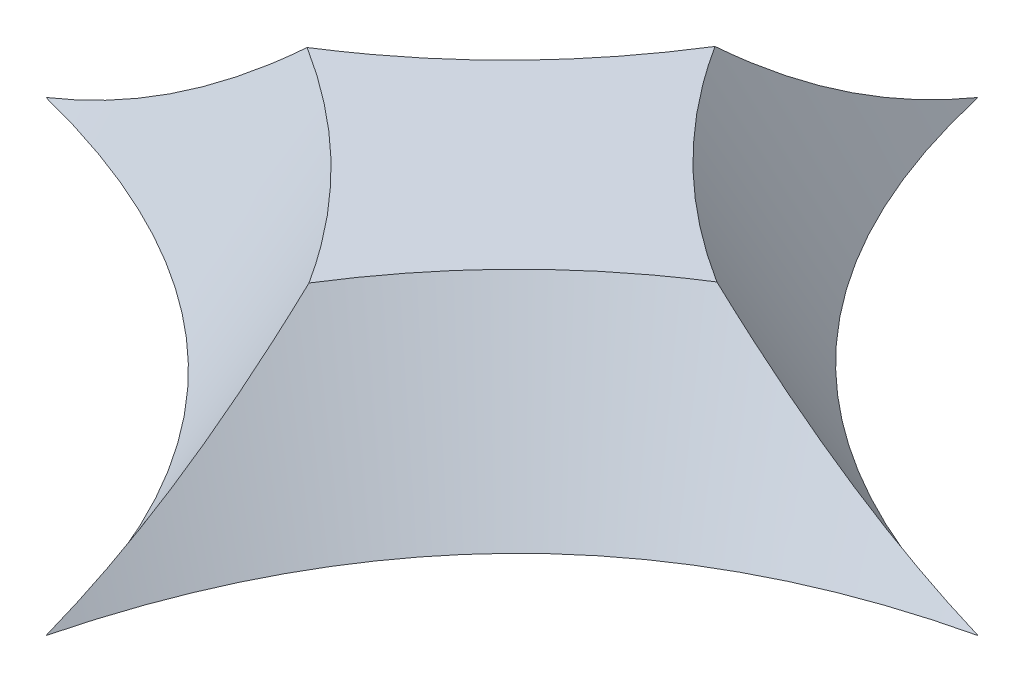
ISO-10303-21;
HEADER;
FILE_DESCRIPTION(('STEP AP214'),'2;1');
FILE_NAME('part.step','',(''),(''),'','','');
FILE_SCHEMA(('AUTOMOTIVE_DESIGN { 1 0 10303 214 1 1 1 1 }'));
ENDSEC;
DATA;
#1=APPLICATION_CONTEXT('core data for automotive mechanical design processes');
#2=APPLICATION_PROTOCOL_DEFINITION('international standard','automotive_design',2000,#1);
#3=PRODUCT_CONTEXT('',#1,'mechanical');
#4=PRODUCT('Part','Part','',(#3));
#5=PRODUCT_RELATED_PRODUCT_CATEGORY('part','',(#4));
#6=PRODUCT_DEFINITION_FORMATION('','',#4);
#7=PRODUCT_DEFINITION_CONTEXT('part definition',#1,'design');
#8=PRODUCT_DEFINITION('design','',#6,#7);
#9=PRODUCT_DEFINITION_SHAPE('','',#8);
#10=(LENGTH_UNIT() NAMED_UNIT(*) SI_UNIT(.MILLI.,.METRE.));
#11=(NAMED_UNIT(*) PLANE_ANGLE_UNIT() SI_UNIT($,.RADIAN.));
#12=(NAMED_UNIT(*) SI_UNIT($,.STERADIAN.) SOLID_ANGLE_UNIT());
#13=UNCERTAINTY_MEASURE_WITH_UNIT(LENGTH_MEASURE(1.E-05),#10,'distance_accuracy_value','');
#14=(GEOMETRIC_REPRESENTATION_CONTEXT(3) GLOBAL_UNCERTAINTY_ASSIGNED_CONTEXT((#13)) GLOBAL_UNIT_ASSIGNED_CONTEXT((#10,
#11,#12)) REPRESENTATION_CONTEXT('',''));
#15=CARTESIAN_POINT('',(0.,0.,0.));
#16=DIRECTION('',(0.,0.,1.));
#17=DIRECTION('',(1.,0.,0.));
#18=AXIS2_PLACEMENT_3D('',#15,#16,#17);
#19=CARTESIAN_POINT('',(0.,0.,-8.));
#20=CARTESIAN_POINT('',(-0.275764776781379,0.,-6.90933460925183));
#21=CARTESIAN_POINT('',(-0.649255026033141,0.,-5.92466889952442));
#22=CARTESIAN_POINT('',(-1.5916864694806,0.,-4.16733684210909));
#23=CARTESIAN_POINT('',(-2.1606276636759,0.,-3.39467049442248));
#24=CARTESIAN_POINT('',(-3.49396099700911,0.,-2.06133716108887));
#25=CARTESIAN_POINT('',(-4.25835313614752,0.,-1.50067017544263));
#26=CARTESIAN_POINT('',(-5.98258835936625,0.,-0.591335566190908));
#27=CARTESIAN_POINT('',(-6.94243144344786,0.,-0.242667942586027));
#28=CARTESIAN_POINT('',(-8.,0.,0.));
#29=CARTESIAN_POINT('',(2.01504918773142,3.6,-7.49051322782323));
#30=CARTESIAN_POINT('',(1.70297305232779,3.6,-6.25623434341139));
#31=CARTESIAN_POINT('',(1.27190158898021,3.6,-5.10919619744064));
#32=CARTESIAN_POINT('',(0.150529163695324,3.6,-3.01819666344593));
#33=CARTESIAN_POINT('',(-0.541227016658254,3.6,-2.07468344995853));
#34=CARTESIAN_POINT('',(-2.17397395268695,3.6,-0.441936514212987));
#35=CARTESIAN_POINT('',(-3.11355026086498,3.6,0.245374439857077));
#36=CARTESIAN_POINT('',(-5.18824372550521,3.6,1.33953522925552));
#37=CARTESIAN_POINT('',(-6.32240038355145,3.6,1.74753652130328));
#38=CARTESIAN_POINT('',(-7.53515997110178,3.6,2.02581434182252));
#39=B_SPLINE_SURFACE_WITH_KNOTS('',1,3,((#19,#20,#21,#22,#23,#24,#25,#26,#27,#28),(#29,#30,#31,
#32,#33,#34,#35,#36,#37,#38)),.UNSPECIFIED.,.F.,.F.,.F.,(2,2),(4,2,2,2,4),(0.,1.),(0.,0.25,0.5,
0.75,1.),.UNSPECIFIED.);
#40=CARTESIAN_POINT('',(0.,0.,-8.));
#41=CARTESIAN_POINT('',(-0.0573909267313728,0.,-7.77303467409908));
#42=CARTESIAN_POINT('',(-0.119854685287259,0.,-7.54729808256133));
#43=CARTESIAN_POINT('',(-0.255893657694453,0.,-7.09850236238939));
#44=CARTESIAN_POINT('',(-0.329500101076737,0.,-6.87545272360224));
#45=CARTESIAN_POINT('',(-0.488543783053675,0.,-6.43335590264357));
#46=CARTESIAN_POINT('',(-0.573991749906029,0.,-6.21431255615508));
#47=CARTESIAN_POINT('',(-0.757918447436487,0.,-5.78026267058959));
#48=CARTESIAN_POINT('',(-0.85646903900896,0.,-5.56528645431373));
#49=CARTESIAN_POINT('',(-1.06674897596929,0.,-5.14209245391446));
#50=CARTESIAN_POINT('',(-1.17846668066953,0.,-4.93386890458644));
#51=CARTESIAN_POINT('',(-1.41553407069375,0.,-4.52544956752358));
#52=CARTESIAN_POINT('',(-1.54087601340602,0.,-4.32524930780992));
#53=CARTESIAN_POINT('',(-1.7727345311255,0.,-3.98250670964699));
#54=CARTESIAN_POINT('',(-1.87625809102295,0.,-3.8379329538665));
#55=CARTESIAN_POINT('',(-2.09112990897493,0.,-3.55468658486988));
#56=CARTESIAN_POINT('',(-2.20247890597677,0.,-3.41601453093536));
#57=CARTESIAN_POINT('',(-2.43283559938971,0.,-3.14518605266298));
#58=CARTESIAN_POINT('',(-2.55184313117557,0.,-3.01302948837818));
#59=CARTESIAN_POINT('',(-2.79674245772837,0.,-2.75629995241361));
#60=CARTESIAN_POINT('',(-2.92260366249044,0.,-2.63169780903271));
#61=CARTESIAN_POINT('',(-3.18129187477434,0.,-2.3899378215228));
#62=CARTESIAN_POINT('',(-3.31411901973247,0.,-2.27278012437183));
#63=CARTESIAN_POINT('',(-3.58625019284958,0.,-2.04628323609106));
#64=CARTESIAN_POINT('',(-3.72555378671812,0.,-1.93694352195604));
#65=CARTESIAN_POINT('',(-4.08099343830081,0.,-1.67387151824939));
#66=CARTESIAN_POINT('',(-4.30085496157446,0.,-1.52513721384507));
#67=CARTESIAN_POINT('',(-4.75195565930856,0.,-1.24611843915864));
#68=CARTESIAN_POINT('',(-4.98319584603708,0.,-1.11583561436901));
#69=CARTESIAN_POINT('',(-5.45558088026412,0.,-0.873205699555676));
#70=CARTESIAN_POINT('',(-5.69674844502894,0.,-0.760902993108565));
#71=CARTESIAN_POINT('',(-6.18646403652967,0.,-0.553975690531041));
#72=CARTESIAN_POINT('',(-6.43501062586645,0.,-0.459347677301566));
#73=CARTESIAN_POINT('',(-6.90226643955803,0.,-0.298957608287093));
#74=CARTESIAN_POINT('',(-7.12023249444522,0.,-0.231006276000716));
#75=CARTESIAN_POINT('',(-7.55841476758187,0.,-0.106953304416239));
#76=CARTESIAN_POINT('',(-7.77861562926881,0.,-0.0507975615072492));
#77=CARTESIAN_POINT('',(-8.,0.,0.));
#78=B_SPLINE_CURVE_WITH_KNOTS('',3,(#40,#41,#42,#43,#44,#45,#46,#47,#48,#49,#50,#51,#52,#53,#54,
#55,#56,#57,#58,#59,#60,#61,#62,#63,#64,#65,#66,#67,#68,#69,#70,#71,#72,#73,#74,#75,#76,#77),
.UNSPECIFIED.,.F.,.F.,(4,2,2,2,2,2,2,2,2,2,2,2,2,2,2,2,2,2,4),(0.,0.7023468421379,
1.40669989477939,2.11169530501088,2.82073034609147,3.52914318520881,4.23715551982289,
4.770356280917,5.30360745939214,5.83684717910971,6.36787593841666,6.89891517873646,
7.42991886043982,8.22527016763761,9.02069235921077,9.81804873037485,10.615250786423,
11.2998716610307,11.981280246212),.UNSPECIFIED.);
#79=CARTESIAN_POINT('',(0.,0.,-8.));
#80=VERTEX_POINT('',#79);
#81=CARTESIAN_POINT('',(-8.,0.,0.));
#82=VERTEX_POINT('',#81);
#83=EDGE_CURVE('E88',#80,#82,#78,.T.);
#84=CARTESIAN_POINT('',(-3.50132772897756,3.,0.0157700357295836));
#85=CARTESIAN_POINT('',(-3.58660217696573,2.92112802964647,0.0159980146188451));
#86=CARTESIAN_POINT('',(-3.67245229229549,2.84287541612625,0.0162083731137651));
#87=CARTESIAN_POINT('',(-3.84536449994943,2.68771769262917,0.0165873250040903));
#88=CARTESIAN_POINT('',(-3.93242661683495,2.61081261003169,0.0167559175517992));
#89=CARTESIAN_POINT('',(-4.10781736378828,2.458464250142,0.017044799089178));
#90=CARTESIAN_POINT('',(-4.19614595551017,2.383020928753,0.0171650895381377));
#91=CARTESIAN_POINT('',(-4.37360332082983,2.23416007046157,0.0173499846073553));
#92=CARTESIAN_POINT('',(-4.46272423275304,2.16073316717273,0.0174149155236976));
#93=CARTESIAN_POINT('',(-4.64233028676929,2.01555801232064,0.0174795083486336));
#94=CARTESIAN_POINT('',(-4.73281548247838,1.94380982701487,0.0174791676853481));
#95=CARTESIAN_POINT('',(-4.915205521287,1.80211050933092,0.0174098815796205));
#96=CARTESIAN_POINT('',(-5.00711059749483,1.7321596771623,0.0173409247517447));
#97=CARTESIAN_POINT('',(-5.24840276627304,1.55247951754864,0.0170616314444812));
#98=CARTESIAN_POINT('',(-5.39893569583631,1.44428062797032,0.0167910096648436));
#99=CARTESIAN_POINT('',(-5.70388428168913,1.23348697507864,0.0160216384070382));
#100=CARTESIAN_POINT('',(-5.85830001119456,1.13089231755719,0.0155228846240537));
#101=CARTESIAN_POINT('',(-6.17106307157052,0.931949956628384,0.0142645485810968));
#102=CARTESIAN_POINT('',(-6.32940949223654,0.835600825306767,0.0135050261924541));
#103=CARTESIAN_POINT('',(-6.65156555757409,0.648875115144405,0.011685513758406));
#104=CARTESIAN_POINT('',(-6.81541234852834,0.558562518245528,0.0106227912216009));
#105=CARTESIAN_POINT('',(-7.14711761462272,0.38548510204566,0.00817086177547362));
#106=CARTESIAN_POINT('',(-7.31497733010064,0.30272265547193,0.00678155271959889));
#107=CARTESIAN_POINT('',(-7.65463266399603,0.145197811538302,0.0036559275484466));
#108=CARTESIAN_POINT('',(-7.82643249828716,0.0704445199700137,0.0019192227669836));
#109=CARTESIAN_POINT('',(-8.,0.,0.));
#110=B_SPLINE_CURVE_WITH_KNOTS('',3,(#84,#85,#86,#87,#88,#89,#90,#91,#92,#93,#94,#95,#96,#97,
#98,#99,#100,#101,#102,#103,#104,#105,#106,#107,#108,#109),.UNSPECIFIED.,.F.,.F.,(4,2,2,2,2,2,2,
2,2,2,2,2,4),(0.,0.348472495548215,0.696952063236257,1.04542110196226,1.39182173398816,
1.73823601515167,2.08470778618874,2.64073838646123,3.19677947938069,3.75269299297884,
4.31378394461425,4.87505062286499,5.43694879400663),.UNSPECIFIED.);
#111=CARTESIAN_POINT('',(-3.50132772897756,3.,0.0157700357295836));
#112=VERTEX_POINT('',#111);
#113=EDGE_CURVE('E11',#112,#82,#110,.T.);
#114=CARTESIAN_POINT('',(-0.0157700357296791,3.,-3.50132772897746));
#115=CARTESIAN_POINT('',(-0.102341480085947,3.,-3.36343232745548));
#116=CARTESIAN_POINT('',(-0.191703158816903,3.,-3.22731545107103));
#117=CARTESIAN_POINT('',(-0.37602015824517,3.,-2.95890102655863));
#118=CARTESIAN_POINT('',(-0.470976132008466,3.,-2.82660392704009));
#119=CARTESIAN_POINT('',(-0.764319802881898,3.,-2.43575584067087));
#120=CARTESIAN_POINT('',(-0.971098310636349,3.,-2.18338392189374));
#121=CARTESIAN_POINT('',(-1.29518222680969,3.,-1.82164538706248));
#122=CARTESIAN_POINT('',(-1.40440162663122,3.,-1.70492602642679));
#123=CARTESIAN_POINT('',(-1.62785883192801,3.,-1.47638812504596));
#124=CARTESIAN_POINT('',(-1.7420968306769,3.,-1.36456977337775));
#125=CARTESIAN_POINT('',(-2.09185897017497,3.,-1.03697333025701));
#126=CARTESIAN_POINT('',(-2.33464745693901,3.,-0.828812397069436));
#127=CARTESIAN_POINT('',(-2.65915788919417,3.,-0.574042670220229));
#128=CARTESIAN_POINT('',(-2.73320245346723,3.,-0.517406828527924));
#129=CARTESIAN_POINT('',(-2.88267960249897,3.,-0.406009983944878));
#130=CARTESIAN_POINT('',(-2.95811196514096,3.,-0.351248684979181));
#131=CARTESIAN_POINT('',(-3.11074635622329,3.,-0.243312042794778));
#132=CARTESIAN_POINT('',(-3.18795602064874,3.,-0.190147517959262));
#133=CARTESIAN_POINT('',(-3.34368009673592,3.,-0.0857408693182144));
#134=CARTESIAN_POINT('',(-3.4221946890948,3.,-0.0344990150051708));
#135=CARTESIAN_POINT('',(-3.50132772897756,3.,0.0157700357295835));
#136=B_SPLINE_CURVE_WITH_KNOTS('',3,(#114,#115,#116,#117,#118,#119,#120,#121,#122,#123,#124,
#125,#126,#127,#128,#129,#130,#131,#132,#133,#134,#135),.UNSPECIFIED.,.F.,.F.,(4,2,2,2,2,2,2,2,
2,2,4),(0.,0.488371756664548,0.976800638202283,1.9541376089455,2.43356276651518,
2.91300640366669,3.87092454869332,4.1505770741507,4.43018522410616,4.7113870444757,
4.99262813357079),.UNSPECIFIED.);
#137=CARTESIAN_POINT('',(-0.0157700357296791,3.,-3.50132772897746));
#138=VERTEX_POINT('',#137);
#139=EDGE_CURVE('E139',#138,#112,#136,.T.);
#140=CARTESIAN_POINT('',(-0.0157700357296791,3.,-3.50132772897746));
#141=CARTESIAN_POINT('',(-0.0159980146189361,2.92112802964647,-3.58660217696563));
#142=CARTESIAN_POINT('',(-0.0162083731138511,2.84287541612625,-3.67245229229539));
#143=CARTESIAN_POINT('',(-0.0165873250041641,2.68771769262917,-3.84536449994933));
#144=CARTESIAN_POINT('',(-0.0167559175518658,2.6108126100317,-3.93242661683486));
#145=CARTESIAN_POINT('',(-0.017044799089227,2.45846425014202,-4.10781736378819));
#146=CARTESIAN_POINT('',(-0.0171650895381762,2.38302092875302,-4.19614595551009));
#147=CARTESIAN_POINT('',(-0.0173499846073688,2.23416007046159,-4.37360332082975));
#148=CARTESIAN_POINT('',(-0.0174149155236967,2.16073316717276,-4.46272423275297));
#149=CARTESIAN_POINT('',(-0.0174795083486073,2.01555801232068,-4.64233028676922));
#150=CARTESIAN_POINT('',(-0.0174791676853109,1.94380982701493,-4.73281548247832));
#151=CARTESIAN_POINT('',(-0.0174098815795715,1.80211050933099,-4.91520552128696));
#152=CARTESIAN_POINT('',(-0.0173409247516949,1.73215967716238,-5.00711059749479));
#153=CARTESIAN_POINT('',(-0.017061631444434,1.55247951754872,-5.24840276627301));
#154=CARTESIAN_POINT('',(-0.0167910096648026,1.44428062797041,-5.39893569583629));
#155=CARTESIAN_POINT('',(-0.0160216384070138,1.23348697507872,-5.70388428168912));
#156=CARTESIAN_POINT('',(-0.0155228846240396,1.13089231755727,-5.85830001119456));
#157=CARTESIAN_POINT('',(-0.0142645485810998,0.931949956628448,-6.17106307157052));
#158=CARTESIAN_POINT('',(-0.0135050261924638,0.835600825306823,-6.32940949223654));
#159=CARTESIAN_POINT('',(-0.0116855137584216,0.648875115144443,-6.65156555757409));
#160=CARTESIAN_POINT('',(-0.0106227912216156,0.558562518245558,-6.81541234852833));
#161=CARTESIAN_POINT('',(-0.00817086177548192,0.38548510204567,-7.1471176146227));
#162=CARTESIAN_POINT('',(-0.00678155271960162,0.30272265547193,-7.31497733010063));
#163=CARTESIAN_POINT('',(-0.00365592754843467,0.145197811538291,-7.65463266399601));
#164=CARTESIAN_POINT('',(-0.00191922276696256,0.0704445199700026,-7.82643249828715));
#165=CARTESIAN_POINT('',(0.,0.,-8.));
#166=B_SPLINE_CURVE_WITH_KNOTS('',3,(#140,#141,#142,#143,#144,#145,#146,#147,#148,#149,#150,
#151,#152,#153,#154,#155,#156,#157,#158,#159,#160,#161,#162,#163,#164,#165),.UNSPECIFIED.,.F.,
.F.,(4,2,2,2,2,2,2,2,2,2,2,2,4),(0.,0.348472495548216,0.696952063236256,1.04542110196226,
1.39182173398816,1.73823601515167,2.08470778618874,2.64073838646125,3.19677947938072,
3.75269299297888,4.31378394461429,4.87505062286505,5.4369487940067),.UNSPECIFIED.);
#167=EDGE_CURVE('E100',#138,#80,#166,.T.);
#168=ORIENTED_EDGE('',*,*,#83,.T.);
#169=ORIENTED_EDGE('',*,*,#113,.F.);
#170=ORIENTED_EDGE('',*,*,#139,.F.);
#171=ORIENTED_EDGE('',*,*,#167,.T.);
#172=EDGE_LOOP('',(#168,#169,#170,#171));
#173=FACE_BOUND('',#172,.T.);
#174=ADVANCED_FACE('F35',(#173),#39,.F.);
#175=CARTESIAN_POINT('',(-8.,0.,0.));
#176=CARTESIAN_POINT('',(-6.90933460925152,0.,0.275764776781482));
#177=CARTESIAN_POINT('',(-5.92466889952485,0.,0.649255026033161));
#178=CARTESIAN_POINT('',(-4.16733684210865,0.,1.59168646948062));
#179=CARTESIAN_POINT('',(-3.39467049442268,0.,2.16062766367591));
#180=CARTESIAN_POINT('',(-2.06133716108865,0.,3.49396099700912));
#181=CARTESIAN_POINT('',(-1.5006701754425,0.,4.25835313614668));
#182=CARTESIAN_POINT('',(-0.591335566190995,0.,5.98258835936709));
#183=CARTESIAN_POINT('',(-0.242667942586137,0.,6.94243144344728));
#184=CARTESIAN_POINT('',(0.,0.,8.));
#185=CARTESIAN_POINT('',(-7.49051322782324,3.6,-2.01504918773139));
#186=CARTESIAN_POINT('',(-6.25623434341083,3.6,-1.70297305232859));
#187=CARTESIAN_POINT('',(-5.10919619744108,3.6,-1.27190158898041));
#188=CARTESIAN_POINT('',(-3.0181966634455,3.6,-0.150529163695092));
#189=CARTESIAN_POINT('',(-2.07468344995853,3.6,0.541227016658157));
#190=CARTESIAN_POINT('',(-0.441936514212982,3.6,2.17397395268706));
#191=CARTESIAN_POINT('',(0.245374439857092,3.6,3.11355026086455));
#192=CARTESIAN_POINT('',(1.33953522925553,3.6,5.18824372550563));
#193=CARTESIAN_POINT('',(1.74753652130323,3.6,6.32240038355114));
#194=CARTESIAN_POINT('',(2.02581434182255,3.6,7.53515997110178));
#195=B_SPLINE_SURFACE_WITH_KNOTS('',1,3,((#175,#176,#177,#178,#179,#180,#181,#182,#183,#184),
(#185,#186,#187,#188,#189,#190,#191,#192,#193,#194)),.UNSPECIFIED.,.F.,.F.,.F.,(2,2),(4,2,2,2,
4),(0.,1.),(0.,0.25,0.5,0.75,1.),.UNSPECIFIED.);
#196=CARTESIAN_POINT('',(-8.,0.,0.));
#197=CARTESIAN_POINT('',(-7.77303467409909,0.,0.0573909267313981));
#198=CARTESIAN_POINT('',(-7.54729808256135,0.,0.119854685287283));
#199=CARTESIAN_POINT('',(-7.09850236238944,0.,0.255893657694481));
#200=CARTESIAN_POINT('',(-6.87545272360229,0.,0.32950010107677));
#201=CARTESIAN_POINT('',(-6.43335590264362,0.,0.488543783053723));
#202=CARTESIAN_POINT('',(-6.21431255615514,0.,0.573991749906088));
#203=CARTESIAN_POINT('',(-5.78026267058964,0.,0.757918447436564));
#204=CARTESIAN_POINT('',(-5.56528645431376,0.,0.856469039009046));
#205=CARTESIAN_POINT('',(-5.14209245391444,0.,1.06674897596934));
#206=CARTESIAN_POINT('',(-4.93386890458638,0.,1.17846668066954));
#207=CARTESIAN_POINT('',(-4.52544956752348,0.,1.41553407069373));
#208=CARTESIAN_POINT('',(-4.32524930780981,0.,1.540876013406));
#209=CARTESIAN_POINT('',(-3.98250670964696,0.,1.77273453112545));
#210=CARTESIAN_POINT('',(-3.83793295386655,0.,1.87625809102285));
#211=CARTESIAN_POINT('',(-3.55468658487011,0.,2.09112990897474));
#212=CARTESIAN_POINT('',(-3.41601453093567,0.,2.20247890597653));
#213=CARTESIAN_POINT('',(-3.14518605266344,0.,2.43283559938934));
#214=CARTESIAN_POINT('',(-3.01302948837871,0.,2.55184313117513));
#215=CARTESIAN_POINT('',(-2.75629995241424,0.,2.79674245772777));
#216=CARTESIAN_POINT('',(-2.63169780903338,0.,2.92260366248973));
#217=CARTESIAN_POINT('',(-2.38993782152351,0.,3.1812918747734));
#218=CARTESIAN_POINT('',(-2.27278012437255,0.,3.31411901973141));
#219=CARTESIAN_POINT('',(-2.04628323609182,0.,3.58625019284828));
#220=CARTESIAN_POINT('',(-1.9369435219568,0.,3.7255537867167));
#221=CARTESIAN_POINT('',(-1.67387151825019,0.,4.08099343829911));
#222=CARTESIAN_POINT('',(-1.5251372138459,0.,4.30085496157262));
#223=CARTESIAN_POINT('',(-1.24611843915963,0.,4.7519556593065));
#224=CARTESIAN_POINT('',(-1.11583561437012,0.,4.98319584603495));
#225=CARTESIAN_POINT('',(-0.873205699556938,0.,5.45558088026178));
#226=CARTESIAN_POINT('',(-0.760902993109851,0.,5.69674844502648));
#227=CARTESIAN_POINT('',(-0.553975690532291,0.,6.18646403652691));
#228=CARTESIAN_POINT('',(-0.459347677302757,0.,6.43501062586353));
#229=CARTESIAN_POINT('',(-0.298957608287959,0.,6.90226643955544));
#230=CARTESIAN_POINT('',(-0.231006276001351,0.,7.12023249444315));
#231=CARTESIAN_POINT('',(-0.106953304416487,0.,7.55841476758082));
#232=CARTESIAN_POINT('',(-0.0507975615073419,0.,7.77861562926828));
#233=CARTESIAN_POINT('',(0.,0.,8.));
#234=B_SPLINE_CURVE_WITH_KNOTS('',3,(#196,#197,#198,#199,#200,#201,#202,#203,#204,#205,#206,
#207,#208,#209,#210,#211,#212,#213,#214,#215,#216,#217,#218,#219,#220,#221,#222,#223,#224,#225,
#226,#227,#228,#229,#230,#231,#232,#233),.UNSPECIFIED.,.F.,.F.,(4,2,2,2,2,2,2,2,2,2,2,2,2,2,2,2,
2,2,4),(0.,0.70234684213786,1.40669989477934,2.11169530501084,2.82073034609148,3.52914318520886,
4.23715551982297,4.77035628091679,5.30360745939163,5.83684717910892,6.36787593841558,
6.89891517873507,7.42991886043812,8.22527016763551,9.02069235920828,9.81804873037199,
10.6152507864198,11.2998716610291,11.981280246212),.UNSPECIFIED.);
#235=CARTESIAN_POINT('',(0.,0.,8.));
#236=VERTEX_POINT('',#235);
#237=EDGE_CURVE('E84',#82,#236,#234,.T.);
#238=CARTESIAN_POINT('',(0.0157700357296464,3.,3.50132772897742));
#239=CARTESIAN_POINT('',(0.0159980146189095,2.92112802964646,3.58660217696559));
#240=CARTESIAN_POINT('',(0.0162083731138298,2.84287541612624,3.67245229229535));
#241=CARTESIAN_POINT('',(0.0165873250041516,2.68771769262916,3.8453644999493));
#242=CARTESIAN_POINT('',(0.016755917551857,2.61081261003169,3.93242661683482));
#243=CARTESIAN_POINT('',(0.0170447990892237,2.458464250142,4.10781736378816));
#244=CARTESIAN_POINT('',(0.017165089538175,2.383020928753,4.19614595551006));
#245=CARTESIAN_POINT('',(0.017349984607369,2.23416007046157,4.37360332082973));
#246=CARTESIAN_POINT('',(0.0174149155236963,2.16073316717274,4.46272423275295));
#247=CARTESIAN_POINT('',(0.0174795083486026,2.01555801232066,4.64233028676921));
#248=CARTESIAN_POINT('',(0.0174791676853024,1.9438098270149,4.73281548247831));
#249=CARTESIAN_POINT('',(0.0174098815795528,1.80211050933096,4.91520552128695));
#250=CARTESIAN_POINT('',(0.0173409247516698,1.73215967716234,5.00711059749479));
#251=CARTESIAN_POINT('',(0.017061631444392,1.55247951754869,5.24840276627302));
#252=CARTESIAN_POINT('',(0.01679100966475,1.44428062797038,5.3989356958363));
#253=CARTESIAN_POINT('',(0.0160216384069449,1.2334869750787,5.70388428168912));
#254=CARTESIAN_POINT('',(0.0155228846239651,1.13089231755724,5.85830001119456));
#255=CARTESIAN_POINT('',(0.0142645485810202,0.931949956628422,6.17106307157051));
#256=CARTESIAN_POINT('',(0.0135050261923848,0.835600825306795,6.32940949223653));
#257=CARTESIAN_POINT('',(0.0116855137583506,0.648875115144411,6.65156555757408));
#258=CARTESIAN_POINT('',(0.0106227912215521,0.558562518245525,6.81541234852832));
#259=CARTESIAN_POINT('',(0.008170861775439,0.385485102045626,7.14711761462269));
#260=CARTESIAN_POINT('',(0.00678155271957185,0.302722655471876,7.3149773301006));
#261=CARTESIAN_POINT('',(0.00365592754841215,0.145197811538239,7.65463266399599));
#262=CARTESIAN_POINT('',(0.00191922276693412,0.0704445199699634,7.82643249828713));
#263=CARTESIAN_POINT('',(0.,0.,8.));
#264=B_SPLINE_CURVE_WITH_KNOTS('',3,(#238,#239,#240,#241,#242,#243,#244,#245,#246,#247,#248,
#249,#250,#251,#252,#253,#254,#255,#256,#257,#258,#259,#260,#261,#262,#263),.UNSPECIFIED.,.F.,
.F.,(4,2,2,2,2,2,2,2,2,2,2,2,4),(0.,0.348472495548226,0.696952063236276,1.04542110196229,
1.3918217339882,1.73823601515172,2.0847077861888,2.6407383864613,3.19677947938077,
3.75269299297893,4.31378394461434,4.87505062286509,5.43694879400674),.UNSPECIFIED.);
#265=CARTESIAN_POINT('',(0.0157700357296464,3.,3.50132772897742));
#266=VERTEX_POINT('',#265);
#267=EDGE_CURVE('E51',#266,#236,#264,.T.);
#268=CARTESIAN_POINT('',(-3.50132772897756,3.,0.0157700357295836));
#269=CARTESIAN_POINT('',(-3.36343232745565,3.,0.102341480085797));
#270=CARTESIAN_POINT('',(-3.22731545107127,3.,0.191703158816697));
#271=CARTESIAN_POINT('',(-2.958901026559,3.,0.376020158244848));
#272=CARTESIAN_POINT('',(-2.82660392704053,3.,0.470976132008084));
#273=CARTESIAN_POINT('',(-2.43575584067151,3.,0.764319802881335));
#274=CARTESIAN_POINT('',(-2.1833839218945,3.,0.971098310635662));
#275=CARTESIAN_POINT('',(-1.82164538706342,3.,1.29518222680881));
#276=CARTESIAN_POINT('',(-1.70492602642778,3.,1.40440162663027));
#277=CARTESIAN_POINT('',(-1.47638812504705,3.,1.62785883192692));
#278=CARTESIAN_POINT('',(-1.36456977337888,3.,1.74209683067573));
#279=CARTESIAN_POINT('',(-1.03697333025825,3.,2.09185897017355));
#280=CARTESIAN_POINT('',(-0.828812397070712,3.,2.3346474569374));
#281=CARTESIAN_POINT('',(-0.574042670221402,3.,2.6591578891925));
#282=CARTESIAN_POINT('',(-0.51740682852897,3.,2.73320245346568));
#283=CARTESIAN_POINT('',(-0.406009983945678,3.,2.88267960249768));
#284=CARTESIAN_POINT('',(-0.351248684979862,3.,2.9581119651398));
#285=CARTESIAN_POINT('',(-0.24331204279523,3.,3.11074635622241));
#286=CARTESIAN_POINT('',(-0.190147517959603,3.,3.187956020648));
#287=CARTESIAN_POINT('',(-0.0857408693183458,3.,3.34368009673548));
#288=CARTESIAN_POINT('',(-0.0344990150052023,3.,3.4221946890945));
#289=CARTESIAN_POINT('',(0.015770035729646,3.,3.50132772897742));
#290=B_SPLINE_CURVE_WITH_KNOTS('',3,(#268,#269,#270,#271,#272,#273,#274,#275,#276,#277,#278,
#279,#280,#281,#282,#283,#284,#285,#286,#287,#288,#289),.UNSPECIFIED.,.F.,.F.,(4,2,2,2,2,2,2,2,
2,2,4),(0.,0.488371756664285,0.976800638201758,1.95413760894444,2.43356276651387,
2.91300640366513,3.87092454869125,4.15057707414917,4.43018522410516,4.71138704447524,
4.99262813357087),.UNSPECIFIED.);
#291=EDGE_CURVE('E96',#112,#266,#290,.T.);
#292=ORIENTED_EDGE('',*,*,#237,.T.);
#293=ORIENTED_EDGE('',*,*,#267,.F.);
#294=ORIENTED_EDGE('',*,*,#291,.F.);
#295=ORIENTED_EDGE('',*,*,#113,.T.);
#296=EDGE_LOOP('',(#292,#293,#294,#295));
#297=FACE_BOUND('',#296,.T.);
#298=ADVANCED_FACE('F95',(#297),#195,.F.);
#299=CARTESIAN_POINT('',(0.,0.,8.));
#300=CARTESIAN_POINT('',(0.27576477678133,0.,6.90933460925183));
#301=CARTESIAN_POINT('',(0.649255026033108,0.,5.92466889952443));
#302=CARTESIAN_POINT('',(1.59168646948056,0.,4.1673368421091));
#303=CARTESIAN_POINT('',(2.16062766367568,0.,3.39467049442271));
#304=CARTESIAN_POINT('',(3.4939609970093,0.,2.06133716108868));
#305=CARTESIAN_POINT('',(4.25835313614709,0.,1.50067017544265));
#306=CARTESIAN_POINT('',(5.98258835936666,0.,0.591335566190934));
#307=CARTESIAN_POINT('',(6.94243144344756,0.,0.242667942586126));
#308=CARTESIAN_POINT('',(8.,0.,0.));
#309=CARTESIAN_POINT('',(-2.01504918773147,3.6,7.49051322782322));
#310=CARTESIAN_POINT('',(-1.70297305232841,3.6,6.25623434341124));
#311=CARTESIAN_POINT('',(-1.27190158898024,3.6,5.10919619744064));
#312=CARTESIAN_POINT('',(-0.15052916369535,3.6,3.01819666344593));
#313=CARTESIAN_POINT('',(0.54122701665794,3.6,2.07468344995854));
#314=CARTESIAN_POINT('',(2.17397395268725,3.6,0.441936514212998));
#315=CARTESIAN_POINT('',(3.11355026086498,3.6,-0.245374439857054));
#316=CARTESIAN_POINT('',(5.18824372550521,3.6,-1.33953522925549));
#317=CARTESIAN_POINT('',(6.32240038355138,3.6,-1.74753652130357));
#318=CARTESIAN_POINT('',(7.53515997110179,3.6,-2.02581434182249));
#319=B_SPLINE_SURFACE_WITH_KNOTS('',1,3,((#299,#300,#301,#302,#303,#304,#305,#306,#307,#308),
(#309,#310,#311,#312,#313,#314,#315,#316,#317,#318)),.UNSPECIFIED.,.F.,.F.,.F.,(2,2),(4,2,2,2,
4),(0.,1.),(0.,0.25,0.5,0.75,1.),.UNSPECIFIED.);
#320=CARTESIAN_POINT('',(0.,0.,8.));
#321=CARTESIAN_POINT('',(0.0573909267313562,0.,7.77303467409906));
#322=CARTESIAN_POINT('',(0.119854685287224,0.,7.5472980825613));
#323=CARTESIAN_POINT('',(0.255893657694408,0.,7.09850236238936));
#324=CARTESIAN_POINT('',(0.3295001010767,0.,6.87545272360221));
#325=CARTESIAN_POINT('',(0.48854378305365,0.,6.43335590264353));
#326=CARTESIAN_POINT('',(0.573991749906008,0.,6.21431255615504));
#327=CARTESIAN_POINT('',(0.757918447436475,0.,5.78026267058955));
#328=CARTESIAN_POINT('',(0.856469039008955,0.,5.56528645431368));
#329=CARTESIAN_POINT('',(1.06674897596929,0.,5.14209245391439));
#330=CARTESIAN_POINT('',(1.17846668066954,0.,4.93386890458636));
#331=CARTESIAN_POINT('',(1.41553407069377,0.,4.52544956752349));
#332=CARTESIAN_POINT('',(1.54087601340604,0.,4.32524930780983));
#333=CARTESIAN_POINT('',(1.77273453112551,0.,3.98250670964693));
#334=CARTESIAN_POINT('',(1.87625809102293,0.,3.83793295386648));
#335=CARTESIAN_POINT('',(2.09112990897486,0.,3.55468658486994));
#336=CARTESIAN_POINT('',(2.20247890597667,0.,3.41601453093546));
#337=CARTESIAN_POINT('',(2.43283559938954,0.,3.14518605266316));
#338=CARTESIAN_POINT('',(2.55184313117537,0.,3.01302948837839));
#339=CARTESIAN_POINT('',(2.7967424577281,0.,2.75629995241389));
#340=CARTESIAN_POINT('',(2.92260366249013,0.,2.63169780903302));
#341=CARTESIAN_POINT('',(3.18129187477393,0.,2.38993782152314));
#342=CARTESIAN_POINT('',(3.314119019732,0.,2.27278012437218));
#343=CARTESIAN_POINT('',(3.586250192849,0.,2.04628323609144));
#344=CARTESIAN_POINT('',(3.72555378671748,0.,1.93694352195642));
#345=CARTESIAN_POINT('',(4.08099343830004,0.,1.67387151824979));
#346=CARTESIAN_POINT('',(4.30085496157362,0.,1.52513721384549));
#347=CARTESIAN_POINT('',(4.75195565930761,0.,1.24611843915914));
#348=CARTESIAN_POINT('',(4.98319584603609,0.,1.11583561436956));
#349=CARTESIAN_POINT('',(5.45558088026301,0.,0.873205699556295));
#350=CARTESIAN_POINT('',(5.69674844502777,0.,0.760902993109193));
#351=CARTESIAN_POINT('',(6.18646403652834,0.,0.553975690531655));
#352=CARTESIAN_POINT('',(6.43501062586505,0.,0.459347677302157));
#353=CARTESIAN_POINT('',(6.90226643955678,0.,0.298957608287538));
#354=CARTESIAN_POINT('',(7.12023249444422,0.,0.231006276001055));
#355=CARTESIAN_POINT('',(7.55841476758136,0.,0.106953304416399));
#356=CARTESIAN_POINT('',(7.77861562926856,0.,0.0507975615073378));
#357=CARTESIAN_POINT('',(8.,0.,0.));
#358=B_SPLINE_CURVE_WITH_KNOTS('',3,(#320,#321,#322,#323,#324,#325,#326,#327,#328,#329,#330,
#331,#332,#333,#334,#335,#336,#337,#338,#339,#340,#341,#342,#343,#344,#345,#346,#347,#348,#349,
#350,#351,#352,#353,#354,#355,#356,#357),.UNSPECIFIED.,.F.,.F.,(4,2,2,2,2,2,2,2,2,2,2,2,2,2,2,2,
2,2,4),(0.,0.702346842137905,1.40669989477941,2.11169530501091,2.82073034609153,
3.52914318520889,4.23715551982299,4.77035628091696,5.30360745939195,5.83684717910938,
6.36787593841618,6.89891517873583,7.42991886043904,8.22527016763663,9.02069235920959,
9.81804873037348,10.6152507864214,11.2998716610299,11.981280246212),.UNSPECIFIED.);
#359=CARTESIAN_POINT('',(8.,0.,0.));
#360=VERTEX_POINT('',#359);
#361=EDGE_CURVE('E89',#236,#360,#358,.T.);
#362=CARTESIAN_POINT('',(3.50132772897757,3.,-0.0157700357295632));
#363=CARTESIAN_POINT('',(3.58660217696574,2.92112802964646,-0.0159980146188266));
#364=CARTESIAN_POINT('',(3.67245229229549,2.84287541612624,-0.016208373113748));
#365=CARTESIAN_POINT('',(3.84536449994944,2.68771769262915,-0.0165873250040748));
#366=CARTESIAN_POINT('',(3.93242661683496,2.61081261003167,-0.016755917551784));
#367=CARTESIAN_POINT('',(4.10781736378828,2.45846425014198,-0.0170447990891621));
#368=CARTESIAN_POINT('',(4.19614595551018,2.38302092875298,-0.017165089538121));
#369=CARTESIAN_POINT('',(4.37360332082984,2.23416007046155,-0.0173499846073352));
#370=CARTESIAN_POINT('',(4.46272423275305,2.16073316717271,-0.017414915523675));
#371=CARTESIAN_POINT('',(4.6423302867693,2.01555801232062,-0.0174795083486042));
#372=CARTESIAN_POINT('',(4.7328154824784,1.94380982701486,-0.0174791676853143));
#373=CARTESIAN_POINT('',(4.91520552128702,1.8021105093309,-0.0174098815795797));
#374=CARTESIAN_POINT('',(5.00711059749485,1.73215967716229,-0.0173409247517014));
#375=CARTESIAN_POINT('',(5.24840276627306,1.55247951754862,-0.0170616314444318));
#376=CARTESIAN_POINT('',(5.39893569583633,1.4442806279703,-0.0167910096647909));
#377=CARTESIAN_POINT('',(5.70388428168914,1.23348697507861,-0.0160216384069827));
#378=CARTESIAN_POINT('',(5.85830001119457,1.13089231755716,-0.0155228846239986));
#379=CARTESIAN_POINT('',(6.17106307157052,0.931949956628347,-0.0142645485810431));
#380=CARTESIAN_POINT('',(6.32940949223654,0.835600825306727,-0.0135050261924015));
#381=CARTESIAN_POINT('',(6.65156555757409,0.648875115144365,-0.0116855137583566));
#382=CARTESIAN_POINT('',(6.81541234852834,0.558562518245491,-0.0106227912215535));
#383=CARTESIAN_POINT('',(7.14711761462271,0.385485102045628,-0.00817086177542992));
#384=CARTESIAN_POINT('',(7.31497733010063,0.302722655471899,-0.00678155271955682));
#385=CARTESIAN_POINT('',(7.65463266399602,0.14519781153828,-0.00365592754840182));
#386=CARTESIAN_POINT('',(7.82643249828716,0.0704445199699999,-0.00191922276693446));
#387=CARTESIAN_POINT('',(8.,0.,0.));
#388=B_SPLINE_CURVE_WITH_KNOTS('',3,(#362,#363,#364,#365,#366,#367,#368,#369,#370,#371,#372,
#373,#374,#375,#376,#377,#378,#379,#380,#381,#382,#383,#384,#385,#386,#387),.UNSPECIFIED.,.F.,
.F.,(4,2,2,2,2,2,2,2,2,2,2,2,4),(0.,0.348472495548221,0.696952063236266,1.04542110196227,
1.39182173398818,1.73823601515169,2.08470778618876,2.64073838646126,3.19677947938071,
3.75269299297886,4.31378394461425,4.87505062286499,5.43694879400663),.UNSPECIFIED.);
#389=CARTESIAN_POINT('',(3.50132772897757,3.,-0.0157700357295632));
#390=VERTEX_POINT('',#389);
#391=EDGE_CURVE('E150',#390,#360,#388,.T.);
#392=CARTESIAN_POINT('',(0.0157700357296464,3.,3.50132772897742));
#393=CARTESIAN_POINT('',(0.102341480085836,3.,3.36343232745555));
#394=CARTESIAN_POINT('',(0.191703158816708,3.,3.2273154510712));
#395=CARTESIAN_POINT('',(0.3760201582448,3.,2.95890102655901));
#396=CARTESIAN_POINT('',(0.470976132008005,3.,2.82660392704057));
#397=CARTESIAN_POINT('',(0.764319802881153,3.,2.43575584067166));
#398=CARTESIAN_POINT('',(0.971098310635404,3.,2.18338392189472));
#399=CARTESIAN_POINT('',(1.29518222680845,3.,1.82164538706375));
#400=CARTESIAN_POINT('',(1.40440162662988,3.,1.70492602642815));
#401=CARTESIAN_POINT('',(1.62785883192648,3.,1.47638812504749));
#402=CARTESIAN_POINT('',(1.74209683067526,3.,1.36456977337937));
#403=CARTESIAN_POINT('',(2.09185897017301,3.,1.03697333025886));
#404=CARTESIAN_POINT('',(2.33464745693679,3.,0.828812397071386));
#405=CARTESIAN_POINT('',(2.65915788919188,3.,0.574042670222071));
#406=CARTESIAN_POINT('',(2.73320245346513,3.,0.517406828529585));
#407=CARTESIAN_POINT('',(2.88267960249727,3.,0.406009983946184));
#408=CARTESIAN_POINT('',(2.95811196513946,3.,0.351248684980314));
#409=CARTESIAN_POINT('',(3.11074635622221,3.,0.243312042795575));
#410=CARTESIAN_POINT('',(3.18795602064787,3.,0.190147517959896));
#411=CARTESIAN_POINT('',(3.34368009673549,3.,0.0857408693185333));
#412=CARTESIAN_POINT('',(3.42219468909459,3.,0.0344990150053377));
#413=CARTESIAN_POINT('',(3.50132772897757,3.,-0.0157700357295631));
#414=B_SPLINE_CURVE_WITH_KNOTS('',3,(#392,#393,#394,#395,#396,#397,#398,#399,#400,#401,#402,
#403,#404,#405,#406,#407,#408,#409,#410,#411,#412,#413),.UNSPECIFIED.,.F.,.F.,(4,2,2,2,2,2,2,2,
2,2,4),(0.,0.488371756664141,0.976800638201472,1.95413760894385,2.43356276651314,
2.91300640366426,3.8709245486901,4.15057707414828,4.43018522410454,4.71138704447488,
4.99262813357078),.UNSPECIFIED.);
#415=EDGE_CURVE('E63',#266,#390,#414,.T.);
#416=ORIENTED_EDGE('',*,*,#361,.T.);
#417=ORIENTED_EDGE('',*,*,#391,.F.);
#418=ORIENTED_EDGE('',*,*,#415,.F.);
#419=ORIENTED_EDGE('',*,*,#267,.T.);
#420=EDGE_LOOP('',(#416,#417,#418,#419));
#421=FACE_BOUND('',#420,.T.);
#422=ADVANCED_FACE('F37',(#421),#319,.F.);
#423=CARTESIAN_POINT('',(8.,0.,0.));
#424=CARTESIAN_POINT('',(6.90933460925153,0.,-0.275764776781432));
#425=CARTESIAN_POINT('',(5.92466889952486,0.,-0.649255026033126));
#426=CARTESIAN_POINT('',(4.16733684210866,0.,-1.59168646948058));
#427=CARTESIAN_POINT('',(3.3946704944227,0.,-2.1606276636759));
#428=CARTESIAN_POINT('',(2.06133716108867,0.,-3.4939609970091));
#429=CARTESIAN_POINT('',(1.50067017544264,0.,-4.25835313614667));
#430=CARTESIAN_POINT('',(0.591335566190915,0.,-5.98258835936709));
#431=CARTESIAN_POINT('',(0.24266794258617,0.,-6.94243144344726));
#432=CARTESIAN_POINT('',(0.,0.,-8.));
#433=CARTESIAN_POINT('',(7.49051322782322,3.6,2.01504918773144));
#434=CARTESIAN_POINT('',(6.25623434341072,3.6,1.70297305232898));
#435=CARTESIAN_POINT('',(5.10919619744107,3.6,1.27190158898044));
#436=CARTESIAN_POINT('',(3.0181966634455,3.6,0.15052916369512));
#437=CARTESIAN_POINT('',(2.07468344995885,3.6,-0.541227016658047));
#438=CARTESIAN_POINT('',(0.441936514212686,3.6,-2.17397395268715));
#439=CARTESIAN_POINT('',(-0.245374439857069,3.6,-3.11355026086456));
#440=CARTESIAN_POINT('',(-1.33953522925551,3.6,-5.18824372550564));
#441=CARTESIAN_POINT('',(-1.74753652130379,3.6,-6.32240038355101));
#442=CARTESIAN_POINT('',(-2.02581434182252,3.6,-7.53515997110178));
#443=B_SPLINE_SURFACE_WITH_KNOTS('',1,3,((#423,#424,#425,#426,#427,#428,#429,#430,#431,#432),
(#433,#434,#435,#436,#437,#438,#439,#440,#441,#442)),.UNSPECIFIED.,.F.,.F.,.F.,(2,2),(4,2,2,2,
4),(0.,1.),(0.,0.25,0.5,0.75,1.),.UNSPECIFIED.);
#444=CARTESIAN_POINT('',(8.,0.,0.));
#445=CARTESIAN_POINT('',(7.77303467409909,0.,-0.0573909267313429));
#446=CARTESIAN_POINT('',(7.54729808256136,0.,-0.119854685287229));
#447=CARTESIAN_POINT('',(7.09850236238945,0.,-0.255893657694429));
#448=CARTESIAN_POINT('',(6.8754527236023,0.,-0.329500101076719));
#449=CARTESIAN_POINT('',(6.43335590264364,0.,-0.488543783053676));
#450=CARTESIAN_POINT('',(6.21431255615516,0.,-0.573991749906042));
#451=CARTESIAN_POINT('',(5.78026267058966,0.,-0.757918447436518));
#452=CARTESIAN_POINT('',(5.5652864543138,0.,-0.856469039008999));
#453=CARTESIAN_POINT('',(5.14209245391448,0.,-1.06674897596929));
#454=CARTESIAN_POINT('',(4.93386890458643,0.,-1.17846668066949));
#455=CARTESIAN_POINT('',(4.52544956752353,0.,-1.41553407069367));
#456=CARTESIAN_POINT('',(4.32524930780987,0.,-1.54087601340594));
#457=CARTESIAN_POINT('',(3.98250670964701,0.,-1.77273453112539));
#458=CARTESIAN_POINT('',(3.83793295386659,0.,-1.87625809102281));
#459=CARTESIAN_POINT('',(3.55468658487012,0.,-2.09112990897472));
#460=CARTESIAN_POINT('',(3.41601453093567,0.,-2.20247890597652));
#461=CARTESIAN_POINT('',(3.14518605266342,0.,-2.43283559938936));
#462=CARTESIAN_POINT('',(3.01302948837867,0.,-2.55184313117516));
#463=CARTESIAN_POINT('',(2.75629995241419,0.,-2.79674245772782));
#464=CARTESIAN_POINT('',(2.63169780903331,0.,-2.9226036624898));
#465=CARTESIAN_POINT('',(2.38993782152343,0.,-3.1812918747735));
#466=CARTESIAN_POINT('',(2.27278012437247,0.,-3.31411901973153));
#467=CARTESIAN_POINT('',(2.04628323609172,0.,-3.58625019284844));
#468=CARTESIAN_POINT('',(1.93694352195671,0.,-3.72555378671688));
#469=CARTESIAN_POINT('',(1.67387151825009,0.,-4.08099343829934));
#470=CARTESIAN_POINT('',(1.5251372138458,0.,-4.30085496157288));
#471=CARTESIAN_POINT('',(1.24611843915951,0.,-4.7519556593068));
#472=CARTESIAN_POINT('',(1.11583561436998,0.,-4.98319584603526));
#473=CARTESIAN_POINT('',(0.873205699556765,0.,-5.45558088026213));
#474=CARTESIAN_POINT('',(0.760902993109666,0.,-5.69674844502684));
#475=CARTESIAN_POINT('',(0.553975690532103,0.,-6.18646403652732));
#476=CARTESIAN_POINT('',(0.459347677302578,0.,-6.43501062586397));
#477=CARTESIAN_POINT('',(0.298957608287835,0.,-6.90226643955583));
#478=CARTESIAN_POINT('',(0.231006276001268,0.,-7.12023249444346));
#479=CARTESIAN_POINT('',(0.106953304416472,0.,-7.55841476758098));
#480=CARTESIAN_POINT('',(0.050797561507354,0.,-7.77861562926836));
#481=CARTESIAN_POINT('',(0.,0.,-8.));
#482=B_SPLINE_CURVE_WITH_KNOTS('',3,(#444,#445,#446,#447,#448,#449,#450,#451,#452,#453,#454,
#455,#456,#457,#458,#459,#460,#461,#462,#463,#464,#465,#466,#467,#468,#469,#470,#471,#472,#473,
#474,#475,#476,#477,#478,#479,#480,#481),.UNSPECIFIED.,.F.,.F.,(4,2,2,2,2,2,2,2,2,2,2,2,2,2,2,2,
2,2,4),(0.,0.702346842137855,1.40669989477933,2.11169530501083,2.82073034609145,
3.52914318520881,4.2371555198229,4.77035628091677,5.30360745939167,5.83684717910901,
6.36787593841572,6.89891517873526,7.42991886043837,8.22527016763582,9.02069235920866,
9.81804873037244,10.6152507864203,11.2998716610294,11.981280246212),.UNSPECIFIED.);
#483=EDGE_CURVE('E114',#360,#80,#482,.T.);
#484=CARTESIAN_POINT('',(3.50132772897757,3.,-0.0157700357295632));
#485=CARTESIAN_POINT('',(3.36343232745561,3.,-0.102341480085812));
#486=CARTESIAN_POINT('',(3.22731545107118,3.,-0.191703158816749));
#487=CARTESIAN_POINT('',(2.95890102655883,3.,-0.376020158244981));
#488=CARTESIAN_POINT('',(2.82660392704031,3.,-0.470976132008259));
#489=CARTESIAN_POINT('',(2.43575584067117,3.,-0.764319802881645));
#490=CARTESIAN_POINT('',(2.18338392189408,3.,-0.971098310636069));
#491=CARTESIAN_POINT('',(1.82164538706288,3.,-1.29518222680935));
#492=CARTESIAN_POINT('',(1.7049260264272,3.,-1.40440162663086));
#493=CARTESIAN_POINT('',(1.47638812504638,3.,-1.62785883192759));
#494=CARTESIAN_POINT('',(1.36456977337818,3.,-1.74209683067643));
#495=CARTESIAN_POINT('',(1.03697333025744,3.,-2.09185897017439));
#496=CARTESIAN_POINT('',(0.828812397069849,3.,-2.33464745693834));
#497=CARTESIAN_POINT('',(0.574042670220585,3.,-2.65915788919348));
#498=CARTESIAN_POINT('',(0.51740682852823,3.,-2.73320245346658));
#499=CARTESIAN_POINT('',(0.406009983945089,3.,-2.88267960249842));
#500=CARTESIAN_POINT('',(0.351248684979346,3.,-2.95811196514045));
#501=CARTESIAN_POINT('',(0.243312042794858,3.,-3.1107463562229));
#502=CARTESIAN_POINT('',(0.190147517959302,3.,-3.1879560206484));
#503=CARTESIAN_POINT('',(0.0857408693181827,3.,-3.3436800967357));
#504=CARTESIAN_POINT('',(0.0344990150051057,3.,-3.42219468909464));
#505=CARTESIAN_POINT('',(-0.0157700357296795,3.,-3.50132772897746));
#506=B_SPLINE_CURVE_WITH_KNOTS('',3,(#484,#485,#486,#487,#488,#489,#490,#491,#492,#493,#494,
#495,#496,#497,#498,#499,#500,#501,#502,#503,#504,#505),.UNSPECIFIED.,.F.,.F.,(4,2,2,2,2,2,2,2,
2,2,4),(0.,0.488371756664462,0.976800638202109,1.95413760894516,2.43356276651477,
2.91300640366619,3.87092454869265,4.15057707415024,4.4301852241059,4.71138704447564,
4.99262813357094),.UNSPECIFIED.);
#507=EDGE_CURVE('E42',#390,#138,#506,.T.);
#508=ORIENTED_EDGE('',*,*,#483,.T.);
#509=ORIENTED_EDGE('',*,*,#167,.F.);
#510=ORIENTED_EDGE('',*,*,#507,.F.);
#511=ORIENTED_EDGE('',*,*,#391,.T.);
#512=EDGE_LOOP('',(#508,#509,#510,#511));
#513=FACE_BOUND('',#512,.T.);
#514=ADVANCED_FACE('F162',(#513),#443,.F.);
#515=CARTESIAN_POINT('',(0.,3.,0.));
#516=DIRECTION('',(0.,1.,0.));
#517=DIRECTION('',(0.,0.,1.));
#518=AXIS2_PLACEMENT_3D('',#515,#516,#517);
#519=PLANE('',#518);
#520=ORIENTED_EDGE('',*,*,#139,.T.);
#521=ORIENTED_EDGE('',*,*,#291,.T.);
#522=ORIENTED_EDGE('',*,*,#415,.T.);
#523=ORIENTED_EDGE('',*,*,#507,.T.);
#524=EDGE_LOOP('',(#520,#521,#522,#523));
#525=FACE_BOUND('',#524,.T.);
#526=ADVANCED_FACE('F124',(#525),#519,.T.);
#527=CARTESIAN_POINT('',(0.,0.,0.));
#528=DIRECTION('',(0.,1.,0.));
#529=DIRECTION('',(0.,0.,1.));
#530=AXIS2_PLACEMENT_3D('',#527,#528,#529);
#531=PLANE('',#530);
#532=ORIENTED_EDGE('',*,*,#83,.F.);
#533=ORIENTED_EDGE('',*,*,#483,.F.);
#534=ORIENTED_EDGE('',*,*,#361,.F.);
#535=ORIENTED_EDGE('',*,*,#237,.F.);
#536=EDGE_LOOP('',(#532,#533,#534,#535));
#537=FACE_BOUND('',#536,.T.);
#538=ADVANCED_FACE('F85',(#537),#531,.F.);
#539=CLOSED_SHELL('',(#174,#298,#422,#514,#526,#538));
#540=MANIFOLD_SOLID_BREP('B2',#539);
#541=ADVANCED_BREP_SHAPE_REPRESENTATION('',(#18,#540),#14);
#542=SHAPE_DEFINITION_REPRESENTATION(#9,#541);
ENDSEC;
END-ISO-10303-21;
